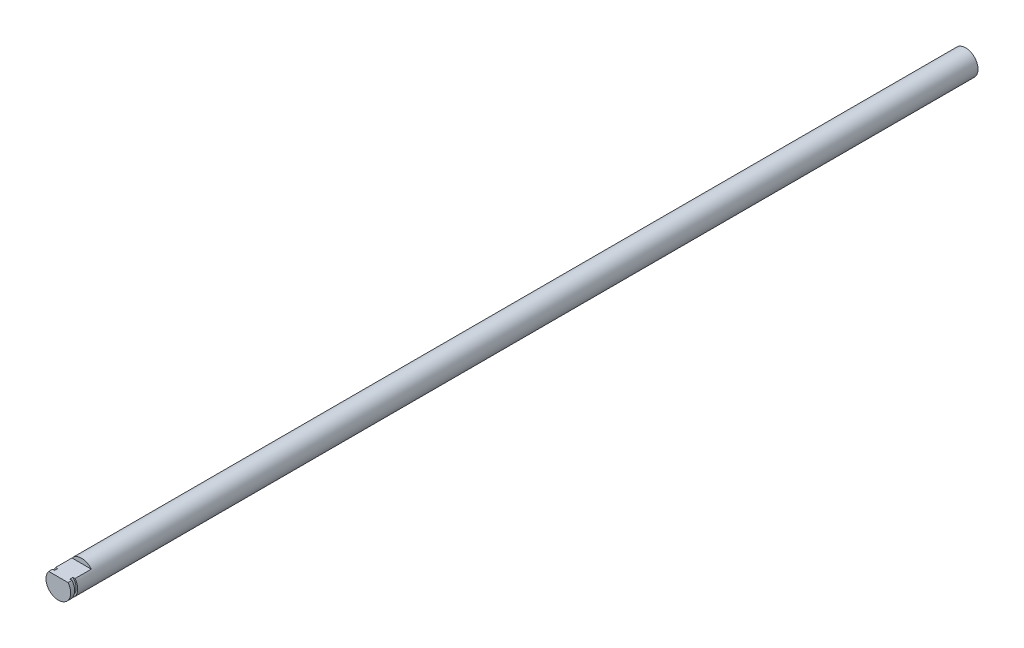
ISO-10303-21;
HEADER;
FILE_DESCRIPTION(('STEP AP214'),'2;1');
FILE_NAME('part.step','',(''),(''),'','','');
FILE_SCHEMA(('AUTOMOTIVE_DESIGN { 1 0 10303 214 1 1 1 1 }'));
ENDSEC;
DATA;
#1=APPLICATION_CONTEXT('core data for automotive mechanical design processes');
#2=APPLICATION_PROTOCOL_DEFINITION('international standard','automotive_design',2000,#1);
#3=PRODUCT_CONTEXT('',#1,'mechanical');
#4=PRODUCT('Part','Part','',(#3));
#5=PRODUCT_RELATED_PRODUCT_CATEGORY('part','',(#4));
#6=PRODUCT_DEFINITION_FORMATION('','',#4);
#7=PRODUCT_DEFINITION_CONTEXT('part definition',#1,'design');
#8=PRODUCT_DEFINITION('design','',#6,#7);
#9=PRODUCT_DEFINITION_SHAPE('','',#8);
#10=(LENGTH_UNIT() NAMED_UNIT(*) SI_UNIT(.MILLI.,.METRE.));
#11=(NAMED_UNIT(*) PLANE_ANGLE_UNIT() SI_UNIT($,.RADIAN.));
#12=(NAMED_UNIT(*) SI_UNIT($,.STERADIAN.) SOLID_ANGLE_UNIT());
#13=UNCERTAINTY_MEASURE_WITH_UNIT(LENGTH_MEASURE(1.E-05),#10,'distance_accuracy_value','');
#14=(GEOMETRIC_REPRESENTATION_CONTEXT(3) GLOBAL_UNCERTAINTY_ASSIGNED_CONTEXT((#13)) GLOBAL_UNIT_ASSIGNED_CONTEXT((#10,
#11,#12)) REPRESENTATION_CONTEXT('',''));
#15=CARTESIAN_POINT('',(0.,0.,0.));
#16=DIRECTION('',(0.,0.,1.));
#17=DIRECTION('',(1.,0.,0.));
#18=AXIS2_PLACEMENT_3D('',#15,#16,#17);
#19=CARTESIAN_POINT('',(0.,0.,325.));
#20=DIRECTION('',(0.,0.,-1.));
#21=DIRECTION('',(-1.,0.,0.));
#22=AXIS2_PLACEMENT_3D('',#19,#20,#21);
#23=CYLINDRICAL_SURFACE('',#22,4.);
#24=CARTESIAN_POINT('',(0.,0.,322.75));
#25=DIRECTION('',(0.,0.,1.));
#26=DIRECTION('',(1.,0.,0.));
#27=AXIS2_PLACEMENT_3D('',#24,#25,#26);
#28=CIRCLE('',#27,4.);
#29=CARTESIAN_POINT('',(-3.1224989991992,2.5,322.75));
#30=VERTEX_POINT('',#29);
#31=CARTESIAN_POINT('',(3.1224989991992,2.5,322.75));
#32=VERTEX_POINT('',#31);
#33=EDGE_CURVE('E101',#30,#32,#28,.T.);
#34=ORIENTED_EDGE('',*,*,#33,.F.);
#35=DIRECTION('',(0.,0.,1.));
#36=VECTOR('',#35,1.);
#37=CARTESIAN_POINT('',(-3.1224989991992,2.5,317.5));
#38=LINE('',#37,#36);
#39=CARTESIAN_POINT('',(-3.1224989991992,2.5,317.5));
#40=VERTEX_POINT('',#39);
#41=EDGE_CURVE('E120',#40,#30,#38,.T.);
#42=ORIENTED_EDGE('',*,*,#41,.F.);
#43=CARTESIAN_POINT('',(0.,0.,317.5));
#44=DIRECTION('',(0.,0.,1.));
#45=DIRECTION('',(1.,0.,0.));
#46=AXIS2_PLACEMENT_3D('',#43,#44,#45);
#47=CIRCLE('',#46,4.);
#48=CARTESIAN_POINT('',(3.1224989991992,2.5,317.5));
#49=VERTEX_POINT('',#48);
#50=EDGE_CURVE('E127',#49,#40,#47,.T.);
#51=ORIENTED_EDGE('',*,*,#50,.F.);
#52=DIRECTION('',(0.,0.,1.));
#53=VECTOR('',#52,1.);
#54=CARTESIAN_POINT('',(3.1224989991992,2.5,317.5));
#55=LINE('',#54,#53);
#56=EDGE_CURVE('E119',#49,#32,#55,.T.);
#57=ORIENTED_EDGE('',*,*,#56,.T.);
#58=EDGE_LOOP('',(#34,#42,#51,#57));
#59=FACE_BOUND('',#58,.T.);
#60=CARTESIAN_POINT('',(0.,0.,32.));
#61=DIRECTION('',(0.,0.,-1.));
#62=DIRECTION('',(-1.,0.,0.));
#63=AXIS2_PLACEMENT_3D('',#60,#61,#62);
#64=CIRCLE('',#63,4.);
#65=CARTESIAN_POINT('',(-4.,0.,32.));
#66=VERTEX_POINT('',#65);
#67=EDGE_CURVE('E135',#66,#66,#64,.T.);
#68=ORIENTED_EDGE('',*,*,#67,.F.);
#69=EDGE_LOOP('',(#68));
#70=FACE_BOUND('',#69,.T.);
#71=ADVANCED_FACE('F40',(#59,#70),#23,.T.);
#72=CARTESIAN_POINT('',(3.1224989991992,2.5,317.5));
#73=DIRECTION('',(0.,-1.,0.));
#74=DIRECTION('',(0.,0.,-1.));
#75=AXIS2_PLACEMENT_3D('',#72,#73,#74);
#76=PLANE('',#75);
#77=DIRECTION('',(-1.,0.,0.));
#78=VECTOR('',#77,1.);
#79=CARTESIAN_POINT('',(3.1224989991992,2.5,322.75));
#80=LINE('',#79,#78);
#81=CARTESIAN_POINT('',(2.44948974278318,2.5,322.75));
#82=VERTEX_POINT('',#81);
#83=EDGE_CURVE('E11',#32,#82,#80,.T.);
#84=ORIENTED_EDGE('',*,*,#83,.F.);
#85=ORIENTED_EDGE('',*,*,#56,.F.);
#86=DIRECTION('',(1.,0.,0.));
#87=VECTOR('',#86,1.);
#88=CARTESIAN_POINT('',(3.1224989991992,2.5,317.5));
#89=LINE('',#88,#87);
#90=EDGE_CURVE('E128',#40,#49,#89,.T.);
#91=ORIENTED_EDGE('',*,*,#90,.F.);
#92=ORIENTED_EDGE('',*,*,#41,.T.);
#93=CARTESIAN_POINT('',(-2.44948974278318,2.5,322.75));
#94=VERTEX_POINT('',#93);
#95=EDGE_CURVE('E50',#94,#30,#80,.T.);
#96=ORIENTED_EDGE('',*,*,#95,.F.);
#97=DIRECTION('',(0.,0.,1.));
#98=VECTOR('',#97,1.);
#99=CARTESIAN_POINT('',(-2.44948974278318,2.5,322.75));
#100=LINE('',#99,#98);
#101=CARTESIAN_POINT('',(-2.44948974278318,2.5,323.75));
#102=VERTEX_POINT('',#101);
#103=EDGE_CURVE('E106',#102,#94,#100,.F.);
#104=ORIENTED_EDGE('',*,*,#103,.F.);
#105=DIRECTION('',(-1.,0.,0.));
#106=VECTOR('',#105,1.);
#107=CARTESIAN_POINT('',(3.1224989991992,2.5,323.75));
#108=LINE('',#107,#106);
#109=CARTESIAN_POINT('',(-3.1224989991992,2.5,323.75));
#110=VERTEX_POINT('',#109);
#111=EDGE_CURVE('E113',#102,#110,#108,.T.);
#112=ORIENTED_EDGE('',*,*,#111,.T.);
#113=CARTESIAN_POINT('',(-3.1224989991992,2.5,325.));
#114=VERTEX_POINT('',#113);
#115=EDGE_CURVE('E65',#110,#114,#38,.T.);
#116=ORIENTED_EDGE('',*,*,#115,.T.);
#117=DIRECTION('',(1.,0.,0.));
#118=VECTOR('',#117,1.);
#119=CARTESIAN_POINT('',(3.1224989991992,2.5,325.));
#120=LINE('',#119,#118);
#121=CARTESIAN_POINT('',(3.1224989991992,2.5,325.));
#122=VERTEX_POINT('',#121);
#123=EDGE_CURVE('E125',#114,#122,#120,.T.);
#124=ORIENTED_EDGE('',*,*,#123,.T.);
#125=CARTESIAN_POINT('',(3.1224989991992,2.5,323.75));
#126=VERTEX_POINT('',#125);
#127=EDGE_CURVE('E123',#126,#122,#55,.T.);
#128=ORIENTED_EDGE('',*,*,#127,.F.);
#129=CARTESIAN_POINT('',(2.44948974278318,2.5,323.75));
#130=VERTEX_POINT('',#129);
#131=EDGE_CURVE('E49',#126,#130,#108,.T.);
#132=ORIENTED_EDGE('',*,*,#131,.T.);
#133=DIRECTION('',(0.,0.,1.));
#134=VECTOR('',#133,1.);
#135=CARTESIAN_POINT('',(2.44948974278318,2.5,322.75));
#136=LINE('',#135,#134);
#137=EDGE_CURVE('E44',#82,#130,#136,.T.);
#138=ORIENTED_EDGE('',*,*,#137,.F.);
#139=EDGE_LOOP('',(#84,#85,#91,#92,#96,#104,#112,#116,#124,#128,#132,#138));
#140=FACE_BOUND('',#139,.T.);
#141=ADVANCED_FACE('F110',(#140),#76,.F.);
#142=ORIENTED_EDGE('',*,*,#115,.F.);
#143=CARTESIAN_POINT('',(0.,0.,323.75));
#144=DIRECTION('',(0.,0.,1.));
#145=DIRECTION('',(1.,0.,0.));
#146=AXIS2_PLACEMENT_3D('',#143,#144,#145);
#147=CIRCLE('',#146,4.);
#148=EDGE_CURVE('E107',#110,#126,#147,.T.);
#149=ORIENTED_EDGE('',*,*,#148,.T.);
#150=ORIENTED_EDGE('',*,*,#127,.T.);
#151=CARTESIAN_POINT('',(0.,0.,325.));
#152=DIRECTION('',(0.,0.,1.));
#153=DIRECTION('',(1.,0.,0.));
#154=AXIS2_PLACEMENT_3D('',#151,#152,#153);
#155=CIRCLE('',#154,4.);
#156=EDGE_CURVE('E116',#114,#122,#155,.T.);
#157=ORIENTED_EDGE('',*,*,#156,.F.);
#158=EDGE_LOOP('',(#142,#149,#150,#157));
#159=FACE_BOUND('',#158,.T.);
#160=ADVANCED_FACE('F42',(#159),#23,.T.);
#161=CARTESIAN_POINT('',(0.,0.,325.));
#162=DIRECTION('',(0.,0.,1.));
#163=DIRECTION('',(1.,0.,0.));
#164=AXIS2_PLACEMENT_3D('',#161,#162,#163);
#165=PLANE('',#164);
#166=ORIENTED_EDGE('',*,*,#123,.F.);
#167=ORIENTED_EDGE('',*,*,#156,.T.);
#168=EDGE_LOOP('',(#166,#167));
#169=FACE_BOUND('',#168,.T.);
#170=ADVANCED_FACE('F149',(#169),#165,.T.);
#171=CARTESIAN_POINT('',(0.,0.,317.5));
#172=DIRECTION('',(0.,0.,1.));
#173=DIRECTION('',(1.,0.,0.));
#174=AXIS2_PLACEMENT_3D('',#171,#172,#173);
#175=PLANE('',#174);
#176=ORIENTED_EDGE('',*,*,#50,.T.);
#177=ORIENTED_EDGE('',*,*,#90,.T.);
#178=EDGE_LOOP('',(#176,#177));
#179=FACE_BOUND('',#178,.T.);
#180=ADVANCED_FACE('F154',(#179),#175,.T.);
#181=CARTESIAN_POINT('',(0.,0.,322.75));
#182=DIRECTION('',(0.,0.,1.));
#183=DIRECTION('',(1.,0.,0.));
#184=AXIS2_PLACEMENT_3D('',#181,#182,#183);
#185=PLANE('',#184);
#186=ORIENTED_EDGE('',*,*,#83,.T.);
#187=CARTESIAN_POINT('',(0.,0.,322.75));
#188=DIRECTION('',(0.,0.,1.));
#189=DIRECTION('',(1.,0.,0.));
#190=AXIS2_PLACEMENT_3D('',#187,#188,#189);
#191=CIRCLE('',#190,3.5);
#192=EDGE_CURVE('E98',#94,#82,#191,.T.);
#193=ORIENTED_EDGE('',*,*,#192,.F.);
#194=ORIENTED_EDGE('',*,*,#95,.T.);
#195=ORIENTED_EDGE('',*,*,#33,.T.);
#196=EDGE_LOOP('',(#186,#193,#194,#195));
#197=FACE_BOUND('',#196,.T.);
#198=ADVANCED_FACE('F97',(#197),#185,.T.);
#199=CARTESIAN_POINT('',(0.,0.,323.75));
#200=DIRECTION('',(0.,0.,1.));
#201=DIRECTION('',(1.,0.,0.));
#202=AXIS2_PLACEMENT_3D('',#199,#200,#201);
#203=PLANE('',#202);
#204=ORIENTED_EDGE('',*,*,#148,.F.);
#205=ORIENTED_EDGE('',*,*,#111,.F.);
#206=CARTESIAN_POINT('',(0.,0.,323.75));
#207=DIRECTION('',(0.,0.,1.));
#208=DIRECTION('',(1.,0.,0.));
#209=AXIS2_PLACEMENT_3D('',#206,#207,#208);
#210=CIRCLE('',#209,3.5);
#211=EDGE_CURVE('E57',#102,#130,#210,.T.);
#212=ORIENTED_EDGE('',*,*,#211,.T.);
#213=ORIENTED_EDGE('',*,*,#131,.F.);
#214=EDGE_LOOP('',(#204,#205,#212,#213));
#215=FACE_BOUND('',#214,.T.);
#216=ADVANCED_FACE('F158',(#215),#203,.F.);
#217=CARTESIAN_POINT('',(0.,0.,322.75));
#218=DIRECTION('',(0.,0.,1.));
#219=DIRECTION('',(1.,0.,0.));
#220=AXIS2_PLACEMENT_3D('',#217,#218,#219);
#221=CYLINDRICAL_SURFACE('',#220,3.5);
#222=ORIENTED_EDGE('',*,*,#137,.T.);
#223=ORIENTED_EDGE('',*,*,#211,.F.);
#224=ORIENTED_EDGE('',*,*,#103,.T.);
#225=ORIENTED_EDGE('',*,*,#192,.T.);
#226=EDGE_LOOP('',(#222,#223,#224,#225));
#227=FACE_BOUND('',#226,.T.);
#228=ADVANCED_FACE('F104',(#227),#221,.T.);
#229=CARTESIAN_POINT('',(0.,0.,32.));
#230=DIRECTION('',(0.,0.,-1.));
#231=DIRECTION('',(-1.,0.,0.));
#232=AXIS2_PLACEMENT_3D('',#229,#230,#231);
#233=PLANE('',#232);
#234=ORIENTED_EDGE('',*,*,#67,.T.);
#235=EDGE_LOOP('',(#234));
#236=FACE_BOUND('',#235,.T.);
#237=ADVANCED_FACE('F140',(#236),#233,.T.);
#238=CLOSED_SHELL('',(#71,#141,#160,#170,#180,#198,#216,#228,#237));
#239=MANIFOLD_SOLID_BREP('B2',#238);
#240=ADVANCED_BREP_SHAPE_REPRESENTATION('',(#18,#239),#14);
#241=SHAPE_DEFINITION_REPRESENTATION(#9,#240);
ENDSEC;
END-ISO-10303-21;
